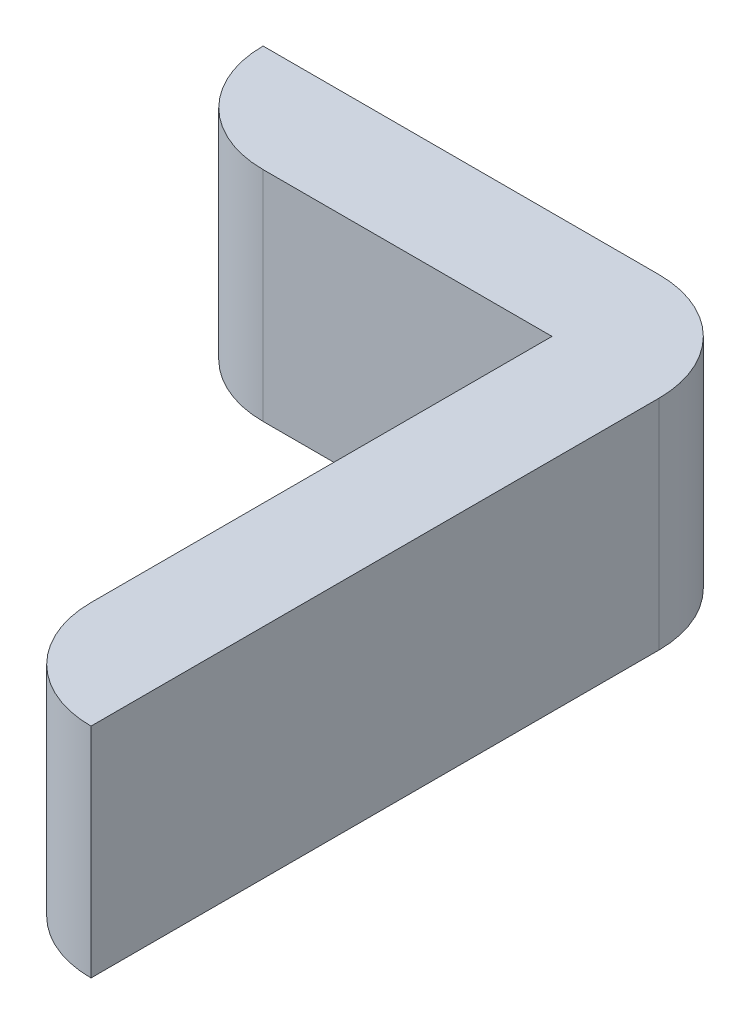
ISO-10303-21;
HEADER;
FILE_DESCRIPTION(('STEP AP214'),'2;1');
FILE_NAME('part.step','',(''),(''),'','','');
FILE_SCHEMA(('AUTOMOTIVE_DESIGN { 1 0 10303 214 1 1 1 1 }'));
ENDSEC;
DATA;
#1=APPLICATION_CONTEXT('core data for automotive mechanical design processes');
#2=APPLICATION_PROTOCOL_DEFINITION('international standard','automotive_design',2000,#1);
#3=PRODUCT_CONTEXT('',#1,'mechanical');
#4=PRODUCT('Part','Part','',(#3));
#5=PRODUCT_RELATED_PRODUCT_CATEGORY('part','',(#4));
#6=PRODUCT_DEFINITION_FORMATION('','',#4);
#7=PRODUCT_DEFINITION_CONTEXT('part definition',#1,'design');
#8=PRODUCT_DEFINITION('design','',#6,#7);
#9=PRODUCT_DEFINITION_SHAPE('','',#8);
#10=(LENGTH_UNIT() NAMED_UNIT(*) SI_UNIT(.MILLI.,.METRE.));
#11=(NAMED_UNIT(*) PLANE_ANGLE_UNIT() SI_UNIT($,.RADIAN.));
#12=(NAMED_UNIT(*) SI_UNIT($,.STERADIAN.) SOLID_ANGLE_UNIT());
#13=UNCERTAINTY_MEASURE_WITH_UNIT(LENGTH_MEASURE(1.E-05),#10,'distance_accuracy_value','');
#14=(GEOMETRIC_REPRESENTATION_CONTEXT(3) GLOBAL_UNCERTAINTY_ASSIGNED_CONTEXT((#13)) GLOBAL_UNIT_ASSIGNED_CONTEXT((#10,
#11,#12)) REPRESENTATION_CONTEXT('',''));
#15=CARTESIAN_POINT('',(0.,0.,0.));
#16=DIRECTION('',(0.,0.,1.));
#17=DIRECTION('',(1.,0.,0.));
#18=AXIS2_PLACEMENT_3D('',#15,#16,#17);
#19=CARTESIAN_POINT('',(9.275,5.3348,0.));
#20=DIRECTION('',(0.,-1.,0.));
#21=DIRECTION('',(0.,0.,-1.));
#22=AXIS2_PLACEMENT_3D('',#19,#20,#21);
#23=PLANE('',#22);
#24=DIRECTION('',(-1.,0.,0.));
#25=VECTOR('',#24,1.);
#26=CARTESIAN_POINT('',(9.525,5.3348,0.25));
#27=LINE('',#26,#25);
#28=CARTESIAN_POINT('',(9.525,5.3348,0.25));
#29=VERTEX_POINT('',#28);
#30=CARTESIAN_POINT('',(10.2,5.3348,0.25));
#31=VERTEX_POINT('',#30);
#32=EDGE_CURVE('E102',#29,#31,#27,.F.);
#33=ORIENTED_EDGE('',*,*,#32,.T.);
#34=DIRECTION('',(0.,0.,-1.));
#35=VECTOR('',#34,1.);
#36=CARTESIAN_POINT('',(10.2,5.3348,0.25));
#37=LINE('',#36,#35);
#38=CARTESIAN_POINT('',(10.2,5.3348,1.327));
#39=VERTEX_POINT('',#38);
#40=EDGE_CURVE('E108',#31,#39,#37,.F.);
#41=ORIENTED_EDGE('',*,*,#40,.T.);
#42=CARTESIAN_POINT('',(10.45,5.3348,1.327));
#43=DIRECTION('',(0.,-1.,0.));
#44=DIRECTION('',(0.,0.,-1.));
#45=AXIS2_PLACEMENT_3D('',#42,#43,#44);
#46=CIRCLE('',#45,0.25);
#47=CARTESIAN_POINT('',(10.45,5.3348,1.577));
#48=VERTEX_POINT('',#47);
#49=EDGE_CURVE('E80',#48,#39,#46,.T.);
#50=ORIENTED_EDGE('',*,*,#49,.F.);
#51=DIRECTION('',(0.,0.,1.));
#52=VECTOR('',#51,1.);
#53=CARTESIAN_POINT('',(10.45,5.3348,1.577));
#54=LINE('',#53,#52);
#55=CARTESIAN_POINT('',(10.45,5.3348,0.25));
#56=VERTEX_POINT('',#55);
#57=EDGE_CURVE('E75',#48,#56,#54,.F.);
#58=ORIENTED_EDGE('',*,*,#57,.T.);
#59=CARTESIAN_POINT('',(10.2,5.3348,0.25));
#60=DIRECTION('',(0.,-1.,0.));
#61=DIRECTION('',(0.,0.,-1.));
#62=AXIS2_PLACEMENT_3D('',#59,#60,#61);
#63=CIRCLE('',#62,0.25);
#64=CARTESIAN_POINT('',(10.2,5.3348,0.));
#65=VERTEX_POINT('',#64);
#66=EDGE_CURVE('E19',#65,#56,#63,.T.);
#67=ORIENTED_EDGE('',*,*,#66,.F.);
#68=DIRECTION('',(1.,0.,0.));
#69=VECTOR('',#68,1.);
#70=CARTESIAN_POINT('',(10.2,5.3348,0.));
#71=LINE('',#70,#69);
#72=CARTESIAN_POINT('',(9.275,5.3348,0.));
#73=VERTEX_POINT('',#72);
#74=EDGE_CURVE('E70',#65,#73,#71,.F.);
#75=ORIENTED_EDGE('',*,*,#74,.T.);
#76=CARTESIAN_POINT('',(9.525,5.3348,0.));
#77=DIRECTION('',(0.,-1.,0.));
#78=DIRECTION('',(0.,0.,-1.));
#79=AXIS2_PLACEMENT_3D('',#76,#77,#78);
#80=CIRCLE('',#79,0.25);
#81=EDGE_CURVE('E121',#29,#73,#80,.T.);
#82=ORIENTED_EDGE('',*,*,#81,.F.);
#83=EDGE_LOOP('',(#33,#41,#50,#58,#67,#75,#82));
#84=FACE_BOUND('',#83,.T.);
#85=ADVANCED_FACE('F16',(#84),#23,.F.);
#86=CARTESIAN_POINT('',(10.2,4.8252,0.));
#87=DIRECTION('',(0.,0.,1.));
#88=DIRECTION('',(1.,0.,0.));
#89=AXIS2_PLACEMENT_3D('',#86,#87,#88);
#90=PLANE('',#89);
#91=DIRECTION('',(0.,-1.,0.));
#92=VECTOR('',#91,1.);
#93=CARTESIAN_POINT('',(9.275,4.8252,0.));
#94=LINE('',#93,#92);
#95=CARTESIAN_POINT('',(9.275,4.8252,0.));
#96=VERTEX_POINT('',#95);
#97=EDGE_CURVE('E123',#73,#96,#94,.T.);
#98=ORIENTED_EDGE('',*,*,#97,.F.);
#99=ORIENTED_EDGE('',*,*,#74,.F.);
#100=DIRECTION('',(0.,-1.,0.));
#101=VECTOR('',#100,1.);
#102=CARTESIAN_POINT('',(10.2,4.8252,0.));
#103=LINE('',#102,#101);
#104=CARTESIAN_POINT('',(10.2,4.8252,0.));
#105=VERTEX_POINT('',#104);
#106=EDGE_CURVE('E92',#105,#65,#103,.F.);
#107=ORIENTED_EDGE('',*,*,#106,.F.);
#108=DIRECTION('',(1.,0.,0.));
#109=VECTOR('',#108,1.);
#110=CARTESIAN_POINT('',(9.275,4.8252,0.));
#111=LINE('',#110,#109);
#112=EDGE_CURVE('E120',#96,#105,#111,.T.);
#113=ORIENTED_EDGE('',*,*,#112,.F.);
#114=EDGE_LOOP('',(#98,#99,#107,#113));
#115=FACE_BOUND('',#114,.T.);
#116=ADVANCED_FACE('F158',(#115),#90,.F.);
#117=CARTESIAN_POINT('',(10.2,4.8252,0.25));
#118=DIRECTION('',(0.,-1.,0.));
#119=DIRECTION('',(0.,0.,-1.));
#120=AXIS2_PLACEMENT_3D('',#117,#118,#119);
#121=CYLINDRICAL_SURFACE('',#120,0.25);
#122=ORIENTED_EDGE('',*,*,#66,.T.);
#123=DIRECTION('',(0.,1.,0.));
#124=VECTOR('',#123,1.);
#125=CARTESIAN_POINT('',(10.45,4.8252,0.25));
#126=LINE('',#125,#124);
#127=CARTESIAN_POINT('',(10.45,4.8252,0.25));
#128=VERTEX_POINT('',#127);
#129=EDGE_CURVE('E86',#56,#128,#126,.F.);
#130=ORIENTED_EDGE('',*,*,#129,.T.);
#131=CARTESIAN_POINT('',(10.2,4.8252,0.25));
#132=DIRECTION('',(0.,-1.,0.));
#133=DIRECTION('',(0.,0.,-1.));
#134=AXIS2_PLACEMENT_3D('',#131,#132,#133);
#135=CIRCLE('',#134,0.25);
#136=EDGE_CURVE('E118',#105,#128,#135,.T.);
#137=ORIENTED_EDGE('',*,*,#136,.F.);
#138=ORIENTED_EDGE('',*,*,#106,.T.);
#139=EDGE_LOOP('',(#122,#130,#137,#138));
#140=FACE_BOUND('',#139,.T.);
#141=ADVANCED_FACE('F89',(#140),#121,.T.);
#142=CARTESIAN_POINT('',(10.45,4.8252,1.577));
#143=DIRECTION('',(-1.,0.,0.));
#144=DIRECTION('',(0.,0.,1.));
#145=AXIS2_PLACEMENT_3D('',#142,#143,#144);
#146=PLANE('',#145);
#147=DIRECTION('',(0.,-1.,0.));
#148=VECTOR('',#147,1.);
#149=CARTESIAN_POINT('',(10.45,4.8252,1.577));
#150=LINE('',#149,#148);
#151=CARTESIAN_POINT('',(10.45,4.8252,1.577));
#152=VERTEX_POINT('',#151);
#153=EDGE_CURVE('E85',#152,#48,#150,.F.);
#154=ORIENTED_EDGE('',*,*,#153,.F.);
#155=DIRECTION('',(0.,0.,-1.));
#156=VECTOR('',#155,1.);
#157=CARTESIAN_POINT('',(10.45,4.8252,0.));
#158=LINE('',#157,#156);
#159=EDGE_CURVE('E94',#128,#152,#158,.F.);
#160=ORIENTED_EDGE('',*,*,#159,.F.);
#161=ORIENTED_EDGE('',*,*,#129,.F.);
#162=ORIENTED_EDGE('',*,*,#57,.F.);
#163=EDGE_LOOP('',(#154,#160,#161,#162));
#164=FACE_BOUND('',#163,.T.);
#165=ADVANCED_FACE('F93',(#164),#146,.F.);
#166=CARTESIAN_POINT('',(10.45,4.8252,1.327));
#167=DIRECTION('',(0.,-1.,0.));
#168=DIRECTION('',(0.,0.,-1.));
#169=AXIS2_PLACEMENT_3D('',#166,#167,#168);
#170=CYLINDRICAL_SURFACE('',#169,0.25);
#171=ORIENTED_EDGE('',*,*,#49,.T.);
#172=DIRECTION('',(0.,1.,0.));
#173=VECTOR('',#172,1.);
#174=CARTESIAN_POINT('',(10.2,4.8252,1.327));
#175=LINE('',#174,#173);
#176=CARTESIAN_POINT('',(10.2,4.8252,1.327));
#177=VERTEX_POINT('',#176);
#178=EDGE_CURVE('E105',#39,#177,#175,.F.);
#179=ORIENTED_EDGE('',*,*,#178,.T.);
#180=CARTESIAN_POINT('',(10.45,4.8252,1.327));
#181=DIRECTION('',(0.,-1.,0.));
#182=DIRECTION('',(0.,0.,-1.));
#183=AXIS2_PLACEMENT_3D('',#180,#181,#182);
#184=CIRCLE('',#183,0.25);
#185=EDGE_CURVE('E114',#152,#177,#184,.T.);
#186=ORIENTED_EDGE('',*,*,#185,.F.);
#187=ORIENTED_EDGE('',*,*,#153,.T.);
#188=EDGE_LOOP('',(#171,#179,#186,#187));
#189=FACE_BOUND('',#188,.T.);
#190=ADVANCED_FACE('F127',(#189),#170,.T.);
#191=CARTESIAN_POINT('',(10.2,4.8252,0.25));
#192=DIRECTION('',(1.,0.,0.));
#193=DIRECTION('',(0.,0.,-1.));
#194=AXIS2_PLACEMENT_3D('',#191,#192,#193);
#195=PLANE('',#194);
#196=ORIENTED_EDGE('',*,*,#178,.F.);
#197=ORIENTED_EDGE('',*,*,#40,.F.);
#198=DIRECTION('',(0.,1.,0.));
#199=VECTOR('',#198,1.);
#200=CARTESIAN_POINT('',(10.2,4.8252,0.25));
#201=LINE('',#200,#199);
#202=CARTESIAN_POINT('',(10.2,4.8252,0.25));
#203=VERTEX_POINT('',#202);
#204=EDGE_CURVE('E104',#31,#203,#201,.F.);
#205=ORIENTED_EDGE('',*,*,#204,.T.);
#206=DIRECTION('',(0.,0.,-1.));
#207=VECTOR('',#206,1.);
#208=CARTESIAN_POINT('',(10.2,4.8252,0.));
#209=LINE('',#208,#207);
#210=EDGE_CURVE('E117',#177,#203,#209,.T.);
#211=ORIENTED_EDGE('',*,*,#210,.F.);
#212=EDGE_LOOP('',(#196,#197,#205,#211));
#213=FACE_BOUND('',#212,.T.);
#214=ADVANCED_FACE('F150',(#213),#195,.F.);
#215=CARTESIAN_POINT('',(9.525,4.8252,0.25));
#216=DIRECTION('',(0.,0.,-1.));
#217=DIRECTION('',(-1.,0.,0.));
#218=AXIS2_PLACEMENT_3D('',#215,#216,#217);
#219=PLANE('',#218);
#220=ORIENTED_EDGE('',*,*,#204,.F.);
#221=ORIENTED_EDGE('',*,*,#32,.F.);
#222=DIRECTION('',(0.,-1.,0.));
#223=VECTOR('',#222,1.);
#224=CARTESIAN_POINT('',(9.525,4.8252,0.25));
#225=LINE('',#224,#223);
#226=CARTESIAN_POINT('',(9.525,4.8252,0.25));
#227=VERTEX_POINT('',#226);
#228=EDGE_CURVE('E34',#227,#29,#225,.F.);
#229=ORIENTED_EDGE('',*,*,#228,.F.);
#230=DIRECTION('',(1.,0.,0.));
#231=VECTOR('',#230,1.);
#232=CARTESIAN_POINT('',(9.275,4.8252,0.25));
#233=LINE('',#232,#231);
#234=EDGE_CURVE('E25',#203,#227,#233,.F.);
#235=ORIENTED_EDGE('',*,*,#234,.F.);
#236=EDGE_LOOP('',(#220,#221,#229,#235));
#237=FACE_BOUND('',#236,.T.);
#238=ADVANCED_FACE('F151',(#237),#219,.F.);
#239=CARTESIAN_POINT('',(9.525,4.8252,0.));
#240=DIRECTION('',(0.,-1.,0.));
#241=DIRECTION('',(0.,0.,-1.));
#242=AXIS2_PLACEMENT_3D('',#239,#240,#241);
#243=CYLINDRICAL_SURFACE('',#242,0.25);
#244=ORIENTED_EDGE('',*,*,#81,.T.);
#245=ORIENTED_EDGE('',*,*,#97,.T.);
#246=CARTESIAN_POINT('',(9.525,4.8252,0.));
#247=DIRECTION('',(0.,-1.,0.));
#248=DIRECTION('',(0.,0.,-1.));
#249=AXIS2_PLACEMENT_3D('',#246,#247,#248);
#250=CIRCLE('',#249,0.25);
#251=EDGE_CURVE('E11',#227,#96,#250,.T.);
#252=ORIENTED_EDGE('',*,*,#251,.F.);
#253=ORIENTED_EDGE('',*,*,#228,.T.);
#254=EDGE_LOOP('',(#244,#245,#252,#253));
#255=FACE_BOUND('',#254,.T.);
#256=ADVANCED_FACE('F156',(#255),#243,.T.);
#257=CARTESIAN_POINT('',(9.275,4.8252,0.));
#258=DIRECTION('',(0.,-1.,0.));
#259=DIRECTION('',(0.,0.,-1.));
#260=AXIS2_PLACEMENT_3D('',#257,#258,#259);
#261=PLANE('',#260);
#262=ORIENTED_EDGE('',*,*,#234,.T.);
#263=ORIENTED_EDGE('',*,*,#251,.T.);
#264=ORIENTED_EDGE('',*,*,#112,.T.);
#265=ORIENTED_EDGE('',*,*,#136,.T.);
#266=ORIENTED_EDGE('',*,*,#159,.T.);
#267=ORIENTED_EDGE('',*,*,#185,.T.);
#268=ORIENTED_EDGE('',*,*,#210,.T.);
#269=EDGE_LOOP('',(#262,#263,#264,#265,#266,#267,#268));
#270=FACE_BOUND('',#269,.T.);
#271=ADVANCED_FACE('F132',(#270),#261,.T.);
#272=CLOSED_SHELL('',(#85,#116,#141,#165,#190,#214,#238,#256,#271));
#273=MANIFOLD_SOLID_BREP('B1',#272);
#274=ADVANCED_BREP_SHAPE_REPRESENTATION('',(#18,#273),#14);
#275=SHAPE_DEFINITION_REPRESENTATION(#9,#274);
ENDSEC;
END-ISO-10303-21;
